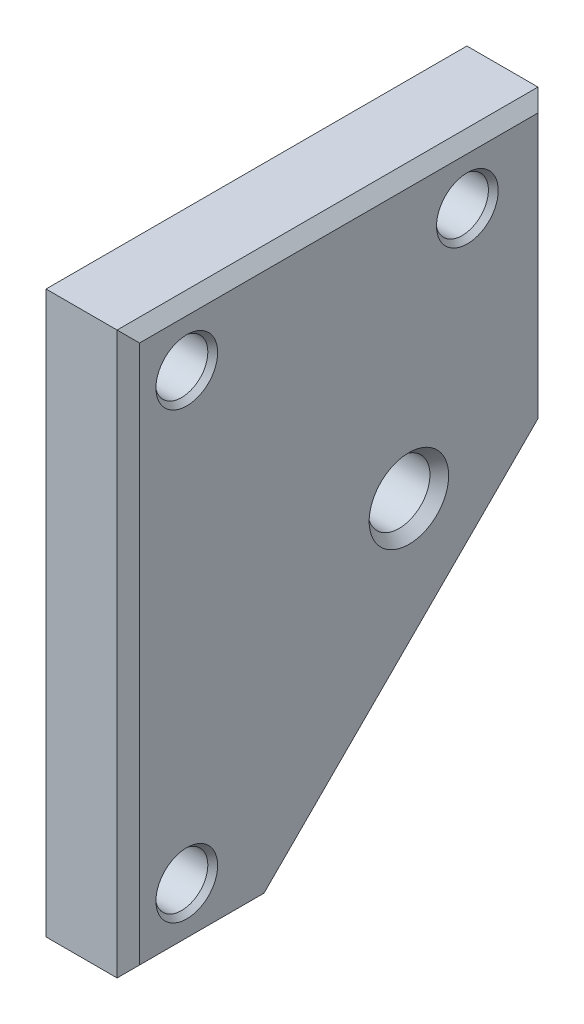
ISO-10303-21;
HEADER;
FILE_DESCRIPTION(('STEP AP214'),'2;1');
FILE_NAME('part.step','',(''),(''),'','','');
FILE_SCHEMA(('AUTOMOTIVE_DESIGN { 1 0 10303 214 1 1 1 1 }'));
ENDSEC;
DATA;
#1=APPLICATION_CONTEXT('core data for automotive mechanical design processes');
#2=APPLICATION_PROTOCOL_DEFINITION('international standard','automotive_design',2000,#1);
#3=PRODUCT_CONTEXT('',#1,'mechanical');
#4=PRODUCT('Part','Part','',(#3));
#5=PRODUCT_RELATED_PRODUCT_CATEGORY('part','',(#4));
#6=PRODUCT_DEFINITION_FORMATION('','',#4);
#7=PRODUCT_DEFINITION_CONTEXT('part definition',#1,'design');
#8=PRODUCT_DEFINITION('design','',#6,#7);
#9=PRODUCT_DEFINITION_SHAPE('','',#8);
#10=(LENGTH_UNIT() NAMED_UNIT(*) SI_UNIT(.MILLI.,.METRE.));
#11=(NAMED_UNIT(*) PLANE_ANGLE_UNIT() SI_UNIT($,.RADIAN.));
#12=(NAMED_UNIT(*) SI_UNIT($,.STERADIAN.) SOLID_ANGLE_UNIT());
#13=UNCERTAINTY_MEASURE_WITH_UNIT(LENGTH_MEASURE(1.E-05),#10,'distance_accuracy_value','');
#14=(GEOMETRIC_REPRESENTATION_CONTEXT(3) GLOBAL_UNCERTAINTY_ASSIGNED_CONTEXT((#13)) GLOBAL_UNIT_ASSIGNED_CONTEXT((#10,
#11,#12)) REPRESENTATION_CONTEXT('',''));
#15=CARTESIAN_POINT('',(0.,0.,0.));
#16=DIRECTION('',(0.,0.,1.));
#17=DIRECTION('',(1.,0.,0.));
#18=AXIS2_PLACEMENT_3D('',#15,#16,#17);
#19=CARTESIAN_POINT('',(12.7,38.1,28.575));
#20=DIRECTION('',(0.,0.,-1.));
#21=DIRECTION('',(-1.,0.,0.));
#22=AXIS2_PLACEMENT_3D('',#19,#20,#21);
#23=PLANE('',#22);
#24=DIRECTION('',(-1.,0.,0.));
#25=VECTOR('',#24,1.);
#26=CARTESIAN_POINT('',(12.7,38.1,28.575));
#27=LINE('',#26,#25);
#28=CARTESIAN_POINT('',(11.176,38.1,28.575));
#29=VERTEX_POINT('',#28);
#30=CARTESIAN_POINT('',(1.52399999999998,38.1,28.575));
#31=VERTEX_POINT('',#30);
#32=EDGE_CURVE('E2512',#29,#31,#27,.T.);
#33=ORIENTED_EDGE('',*,*,#32,.T.);
#34=DIRECTION('',(0.,-1.,0.));
#35=VECTOR('',#34,1.);
#36=CARTESIAN_POINT('',(1.52399999999998,38.1,28.575));
#37=LINE('',#36,#35);
#38=CARTESIAN_POINT('',(1.52399999999998,-38.1,28.575));
#39=VERTEX_POINT('',#38);
#40=EDGE_CURVE('E2452',#31,#39,#37,.T.);
#41=ORIENTED_EDGE('',*,*,#40,.T.);
#42=DIRECTION('',(-1.,0.,0.));
#43=VECTOR('',#42,1.);
#44=CARTESIAN_POINT('',(12.7,-38.1,28.575));
#45=LINE('',#44,#43);
#46=CARTESIAN_POINT('',(11.176,-38.1,28.575));
#47=VERTEX_POINT('',#46);
#48=EDGE_CURVE('E2426',#47,#39,#45,.T.);
#49=ORIENTED_EDGE('',*,*,#48,.F.);
#50=DIRECTION('',(0.,1.,0.));
#51=VECTOR('',#50,1.);
#52=CARTESIAN_POINT('',(11.176,38.1,28.575));
#53=LINE('',#52,#51);
#54=EDGE_CURVE('E2450',#47,#29,#53,.T.);
#55=ORIENTED_EDGE('',*,*,#54,.T.);
#56=EDGE_LOOP('',(#33,#41,#49,#55));
#57=FACE_BOUND('',#56,.T.);
#58=ADVANCED_FACE('F2329',(#57),#23,.F.);
#59=CARTESIAN_POINT('',(12.7,-38.1,28.575));
#60=DIRECTION('',(0.,1.,0.));
#61=DIRECTION('',(0.,0.,1.));
#62=AXIS2_PLACEMENT_3D('',#59,#60,#61);
#63=PLANE('',#62);
#64=ORIENTED_EDGE('',*,*,#48,.T.);
#65=DIRECTION('',(0.,0.,-1.));
#66=VECTOR('',#65,1.);
#67=CARTESIAN_POINT('',(1.52399999999998,-38.1,28.575));
#68=LINE('',#67,#66);
#69=CARTESIAN_POINT('',(1.52399999999998,-38.1,9.525));
#70=VERTEX_POINT('',#69);
#71=EDGE_CURVE('E2456',#39,#70,#68,.T.);
#72=ORIENTED_EDGE('',*,*,#71,.T.);
#73=DIRECTION('',(1.,0.,0.));
#74=VECTOR('',#73,1.);
#75=CARTESIAN_POINT('',(0.,-38.1,9.525));
#76=LINE('',#75,#74);
#77=CARTESIAN_POINT('',(11.176,-38.1,9.525));
#78=VERTEX_POINT('',#77);
#79=EDGE_CURVE('E2536',#70,#78,#76,.T.);
#80=ORIENTED_EDGE('',*,*,#79,.T.);
#81=DIRECTION('',(0.,0.,1.));
#82=VECTOR('',#81,1.);
#83=CARTESIAN_POINT('',(11.176,-38.1,28.575));
#84=LINE('',#83,#82);
#85=EDGE_CURVE('E2454',#78,#47,#84,.T.);
#86=ORIENTED_EDGE('',*,*,#85,.T.);
#87=EDGE_LOOP('',(#64,#72,#80,#86));
#88=FACE_BOUND('',#87,.T.);
#89=ADVANCED_FACE('F2599',(#88),#63,.F.);
#90=CARTESIAN_POINT('',(12.7,38.1,-28.575));
#91=DIRECTION('',(0.,0.,1.));
#92=DIRECTION('',(1.,0.,0.));
#93=AXIS2_PLACEMENT_3D('',#90,#91,#92);
#94=PLANE('',#93);
#95=DIRECTION('',(1.,0.,0.));
#96=VECTOR('',#95,1.);
#97=CARTESIAN_POINT('',(0.,0.,-28.575));
#98=LINE('',#97,#96);
#99=CARTESIAN_POINT('',(1.52399999999998,0.,-28.575));
#100=VERTEX_POINT('',#99);
#101=CARTESIAN_POINT('',(11.176,0.,-28.575));
#102=VERTEX_POINT('',#101);
#103=EDGE_CURVE('E2472',#100,#102,#98,.T.);
#104=ORIENTED_EDGE('',*,*,#103,.F.);
#105=DIRECTION('',(0.,1.,0.));
#106=VECTOR('',#105,1.);
#107=CARTESIAN_POINT('',(1.52399999999998,38.1,-28.575));
#108=LINE('',#107,#106);
#109=CARTESIAN_POINT('',(1.52399999999998,38.1,-28.575));
#110=VERTEX_POINT('',#109);
#111=EDGE_CURVE('E2444',#100,#110,#108,.T.);
#112=ORIENTED_EDGE('',*,*,#111,.T.);
#113=DIRECTION('',(-1.,0.,0.));
#114=VECTOR('',#113,1.);
#115=CARTESIAN_POINT('',(12.7,38.1,-28.575));
#116=LINE('',#115,#114);
#117=CARTESIAN_POINT('',(11.176,38.1,-28.575));
#118=VERTEX_POINT('',#117);
#119=EDGE_CURVE('E2509',#118,#110,#116,.T.);
#120=ORIENTED_EDGE('',*,*,#119,.F.);
#121=DIRECTION('',(0.,-1.,0.));
#122=VECTOR('',#121,1.);
#123=CARTESIAN_POINT('',(11.176,0.,-28.575));
#124=LINE('',#123,#122);
#125=EDGE_CURVE('E2441',#118,#102,#124,.T.);
#126=ORIENTED_EDGE('',*,*,#125,.T.);
#127=EDGE_LOOP('',(#104,#112,#120,#126));
#128=FACE_BOUND('',#127,.T.);
#129=ADVANCED_FACE('F2515',(#128),#94,.F.);
#130=CARTESIAN_POINT('',(12.7,38.1,28.575));
#131=DIRECTION('',(0.,-1.,0.));
#132=DIRECTION('',(0.,0.,-1.));
#133=AXIS2_PLACEMENT_3D('',#130,#131,#132);
#134=PLANE('',#133);
#135=ORIENTED_EDGE('',*,*,#119,.T.);
#136=DIRECTION('',(0.,0.,1.));
#137=VECTOR('',#136,1.);
#138=CARTESIAN_POINT('',(1.52399999999998,38.1,28.575));
#139=LINE('',#138,#137);
#140=EDGE_CURVE('E2448',#110,#31,#139,.T.);
#141=ORIENTED_EDGE('',*,*,#140,.T.);
#142=ORIENTED_EDGE('',*,*,#32,.F.);
#143=DIRECTION('',(0.,0.,-1.));
#144=VECTOR('',#143,1.);
#145=CARTESIAN_POINT('',(11.176,38.1,-28.575));
#146=LINE('',#145,#144);
#147=EDGE_CURVE('E2446',#29,#118,#146,.T.);
#148=ORIENTED_EDGE('',*,*,#147,.T.);
#149=EDGE_LOOP('',(#135,#141,#142,#148));
#150=FACE_BOUND('',#149,.T.);
#151=ADVANCED_FACE('F2508',(#150),#134,.F.);
#152=CARTESIAN_POINT('',(12.7,-38.1,28.575));
#153=DIRECTION('',(1.,0.,0.));
#154=DIRECTION('',(0.,0.,-1.));
#155=AXIS2_PLACEMENT_3D('',#152,#153,#154);
#156=PLANE('',#155);
#157=DIRECTION('',(0.,0.707106781186547,-0.707106781186548));
#158=VECTOR('',#157,1.);
#159=CARTESIAN_POINT('',(12.7,1.07763073452828,-27.4973692654717));
#160=LINE('',#159,#158);
#161=CARTESIAN_POINT('',(12.7,-36.576,10.1562614690566));
#162=VERTEX_POINT('',#161);
#163=CARTESIAN_POINT('',(12.7,0.631261469056575,-27.051));
#164=VERTEX_POINT('',#163);
#165=EDGE_CURVE('E2338',#162,#164,#160,.T.);
#166=ORIENTED_EDGE('',*,*,#165,.T.);
#167=DIRECTION('',(0.,1.,0.));
#168=VECTOR('',#167,1.);
#169=CARTESIAN_POINT('',(12.7,38.1,-27.051));
#170=LINE('',#169,#168);
#171=CARTESIAN_POINT('',(12.7,36.576,-27.051));
#172=VERTEX_POINT('',#171);
#173=EDGE_CURVE('E14',#164,#172,#170,.T.);
#174=ORIENTED_EDGE('',*,*,#173,.T.);
#175=DIRECTION('',(0.,0.,1.));
#176=VECTOR('',#175,1.);
#177=CARTESIAN_POINT('',(12.7,36.576,28.575));
#178=LINE('',#177,#176);
#179=CARTESIAN_POINT('',(12.7,36.576,27.051));
#180=VERTEX_POINT('',#179);
#181=EDGE_CURVE('E2458',#172,#180,#178,.T.);
#182=ORIENTED_EDGE('',*,*,#181,.T.);
#183=DIRECTION('',(0.,-1.,0.));
#184=VECTOR('',#183,1.);
#185=CARTESIAN_POINT('',(12.7,-38.1,27.051));
#186=LINE('',#185,#184);
#187=CARTESIAN_POINT('',(12.7,-36.576,27.051));
#188=VERTEX_POINT('',#187);
#189=EDGE_CURVE('E2460',#180,#188,#186,.T.);
#190=ORIENTED_EDGE('',*,*,#189,.T.);
#191=DIRECTION('',(0.,0.,-1.));
#192=VECTOR('',#191,1.);
#193=CARTESIAN_POINT('',(12.7,-36.576,9.525));
#194=LINE('',#193,#192);
#195=EDGE_CURVE('E2349',#188,#162,#194,.T.);
#196=ORIENTED_EDGE('',*,*,#195,.T.);
#197=EDGE_LOOP('',(#166,#174,#182,#190,#196));
#198=FACE_BOUND('',#197,.T.);
#199=CARTESIAN_POINT('',(12.7,0.,-9.525));
#200=DIRECTION('',(1.,0.,0.));
#201=DIRECTION('',(0.,0.,-1.));
#202=AXIS2_PLACEMENT_3D('',#199,#200,#201);
#203=CIRCLE('',#202,5.3975);
#204=CARTESIAN_POINT('',(12.7,0.,-14.9225));
#205=VERTEX_POINT('',#204);
#206=EDGE_CURVE('E2549',#205,#205,#203,.T.);
#207=ORIENTED_EDGE('',*,*,#206,.F.);
#208=EDGE_LOOP('',(#207));
#209=FACE_BOUND('',#208,.T.);
#210=CARTESIAN_POINT('',(12.7,30.1625,20.6375));
#211=DIRECTION('',(1.,0.,0.));
#212=DIRECTION('',(0.,0.,-1.));
#213=AXIS2_PLACEMENT_3D('',#210,#211,#212);
#214=CIRCLE('',#213,4.191);
#215=CARTESIAN_POINT('',(12.7,30.1625,16.4465));
#216=VERTEX_POINT('',#215);
#217=EDGE_CURVE('E2561',#216,#216,#214,.T.);
#218=ORIENTED_EDGE('',*,*,#217,.F.);
#219=EDGE_LOOP('',(#218));
#220=FACE_BOUND('',#219,.T.);
#221=CARTESIAN_POINT('',(12.7,-30.1625,20.6375));
#222=DIRECTION('',(1.,0.,0.));
#223=DIRECTION('',(0.,0.,-1.));
#224=AXIS2_PLACEMENT_3D('',#221,#222,#223);
#225=CIRCLE('',#224,4.191);
#226=CARTESIAN_POINT('',(12.7,-30.1625,16.4465));
#227=VERTEX_POINT('',#226);
#228=EDGE_CURVE('E2573',#227,#227,#225,.T.);
#229=ORIENTED_EDGE('',*,*,#228,.F.);
#230=EDGE_LOOP('',(#229));
#231=FACE_BOUND('',#230,.T.);
#232=CARTESIAN_POINT('',(12.7,30.1625,-17.4625));
#233=DIRECTION('',(1.,0.,0.));
#234=DIRECTION('',(0.,0.,-1.));
#235=AXIS2_PLACEMENT_3D('',#232,#233,#234);
#236=CIRCLE('',#235,4.191);
#237=CARTESIAN_POINT('',(12.7,30.1625,-21.6535));
#238=VERTEX_POINT('',#237);
#239=EDGE_CURVE('E2521',#238,#238,#236,.T.);
#240=ORIENTED_EDGE('',*,*,#239,.F.);
#241=EDGE_LOOP('',(#240));
#242=FACE_BOUND('',#241,.T.);
#243=ADVANCED_FACE('F2499',(#198,#209,#220,#231,#242),#156,.T.);
#244=CARTESIAN_POINT('',(0.,-38.1,28.575));
#245=DIRECTION('',(1.,0.,0.));
#246=DIRECTION('',(0.,0.,-1.));
#247=AXIS2_PLACEMENT_3D('',#244,#245,#246);
#248=PLANE('',#247);
#249=DIRECTION('',(0.,-1.,0.));
#250=VECTOR('',#249,1.);
#251=CARTESIAN_POINT('',(0.,-38.1,-27.051));
#252=LINE('',#251,#250);
#253=CARTESIAN_POINT('',(0.,36.576,-27.051));
#254=VERTEX_POINT('',#253);
#255=CARTESIAN_POINT('',(0.,0.631261469056589,-27.051));
#256=VERTEX_POINT('',#255);
#257=EDGE_CURVE('E2431',#254,#256,#252,.T.);
#258=ORIENTED_EDGE('',*,*,#257,.T.);
#259=DIRECTION('',(0.,-0.707106781186547,0.707106781186548));
#260=VECTOR('',#259,1.);
#261=CARTESIAN_POINT('',(0.,-46.5473692654717,20.1276307345283));
#262=LINE('',#261,#260);
#263=CARTESIAN_POINT('',(0.,-36.576,10.1562614690566));
#264=VERTEX_POINT('',#263);
#265=EDGE_CURVE('E2411',#256,#264,#262,.T.);
#266=ORIENTED_EDGE('',*,*,#265,.T.);
#267=DIRECTION('',(0.,0.,1.));
#268=VECTOR('',#267,1.);
#269=CARTESIAN_POINT('',(0.,-36.576,28.575));
#270=LINE('',#269,#268);
#271=CARTESIAN_POINT('',(0.,-36.576,27.051));
#272=VERTEX_POINT('',#271);
#273=EDGE_CURVE('E2419',#264,#272,#270,.T.);
#274=ORIENTED_EDGE('',*,*,#273,.T.);
#275=DIRECTION('',(0.,1.,0.));
#276=VECTOR('',#275,1.);
#277=CARTESIAN_POINT('',(0.,-38.1,27.051));
#278=LINE('',#277,#276);
#279=CARTESIAN_POINT('',(0.,36.576,27.051));
#280=VERTEX_POINT('',#279);
#281=EDGE_CURVE('E2425',#272,#280,#278,.T.);
#282=ORIENTED_EDGE('',*,*,#281,.T.);
#283=DIRECTION('',(0.,0.,-1.));
#284=VECTOR('',#283,1.);
#285=CARTESIAN_POINT('',(0.,36.576,28.575));
#286=LINE('',#285,#284);
#287=EDGE_CURVE('E2436',#280,#254,#286,.T.);
#288=ORIENTED_EDGE('',*,*,#287,.T.);
#289=EDGE_LOOP('',(#258,#266,#274,#282,#288));
#290=FACE_BOUND('',#289,.T.);
#291=CARTESIAN_POINT('',(0.,0.,-9.525));
#292=DIRECTION('',(1.,0.,0.));
#293=DIRECTION('',(0.,0.,-1.));
#294=AXIS2_PLACEMENT_3D('',#291,#292,#293);
#295=CIRCLE('',#294,5.3975);
#296=CARTESIAN_POINT('',(0.,0.,-14.9225));
#297=VERTEX_POINT('',#296);
#298=EDGE_CURVE('E2538',#297,#297,#295,.T.);
#299=ORIENTED_EDGE('',*,*,#298,.T.);
#300=EDGE_LOOP('',(#299));
#301=FACE_BOUND('',#300,.T.);
#302=CARTESIAN_POINT('',(0.,30.1625,20.6375));
#303=DIRECTION('',(1.,0.,0.));
#304=DIRECTION('',(0.,0.,-1.));
#305=AXIS2_PLACEMENT_3D('',#302,#303,#304);
#306=CIRCLE('',#305,4.191);
#307=CARTESIAN_POINT('',(0.,30.1625,16.4465));
#308=VERTEX_POINT('',#307);
#309=EDGE_CURVE('E2552',#308,#308,#306,.T.);
#310=ORIENTED_EDGE('',*,*,#309,.T.);
#311=EDGE_LOOP('',(#310));
#312=FACE_BOUND('',#311,.T.);
#313=CARTESIAN_POINT('',(0.,-30.1625,20.6375));
#314=DIRECTION('',(1.,0.,0.));
#315=DIRECTION('',(0.,0.,-1.));
#316=AXIS2_PLACEMENT_3D('',#313,#314,#315);
#317=CIRCLE('',#316,4.191);
#318=CARTESIAN_POINT('',(0.,-30.1625,16.4465));
#319=VERTEX_POINT('',#318);
#320=EDGE_CURVE('E2564',#319,#319,#317,.T.);
#321=ORIENTED_EDGE('',*,*,#320,.T.);
#322=EDGE_LOOP('',(#321));
#323=FACE_BOUND('',#322,.T.);
#324=CARTESIAN_POINT('',(0.,30.1625,-17.4625));
#325=DIRECTION('',(1.,0.,0.));
#326=DIRECTION('',(0.,0.,-1.));
#327=AXIS2_PLACEMENT_3D('',#324,#325,#326);
#328=CIRCLE('',#327,4.191);
#329=CARTESIAN_POINT('',(0.,30.1625,-21.6535));
#330=VERTEX_POINT('',#329);
#331=EDGE_CURVE('E2576',#330,#330,#328,.T.);
#332=ORIENTED_EDGE('',*,*,#331,.T.);
#333=EDGE_LOOP('',(#332));
#334=FACE_BOUND('',#333,.T.);
#335=ADVANCED_FACE('F2428',(#290,#301,#312,#323,#334),#248,.F.);
#336=CARTESIAN_POINT('',(12.7,30.1625,-17.4625));
#337=DIRECTION('',(1.,0.,0.));
#338=DIRECTION('',(0.,0.,-1.));
#339=AXIS2_PLACEMENT_3D('',#336,#337,#338);
#340=CONICAL_SURFACE('',#339,4.191,0.715584993317678);
#341=CARTESIAN_POINT('',(11.9870476759407,30.1625,-17.4625));
#342=DIRECTION('',(1.,0.,0.));
#343=DIRECTION('',(0.,0.,-1.));
#344=AXIS2_PLACEMENT_3D('',#341,#342,#343);
#345=CIRCLE('',#344,3.57124);
#346=CARTESIAN_POINT('',(11.9870476759407,30.1625,-21.03374));
#347=VERTEX_POINT('',#346);
#348=EDGE_CURVE('E2582',#347,#347,#345,.T.);
#349=ORIENTED_EDGE('',*,*,#348,.F.);
#350=EDGE_LOOP('',(#349));
#351=FACE_BOUND('',#350,.T.);
#352=ORIENTED_EDGE('',*,*,#239,.T.);
#353=EDGE_LOOP('',(#352));
#354=FACE_BOUND('',#353,.T.);
#355=ADVANCED_FACE('F2587',(#351,#354),#340,.F.);
#356=CARTESIAN_POINT('',(12.7,30.1625,-17.4625));
#357=DIRECTION('',(1.,0.,0.));
#358=DIRECTION('',(0.,0.,-1.));
#359=AXIS2_PLACEMENT_3D('',#356,#357,#358);
#360=CYLINDRICAL_SURFACE('',#359,3.57124);
#361=CARTESIAN_POINT('',(0.712952324059294,30.1625,-17.4625));
#362=DIRECTION('',(1.,0.,0.));
#363=DIRECTION('',(0.,0.,-1.));
#364=AXIS2_PLACEMENT_3D('',#361,#362,#363);
#365=CIRCLE('',#364,3.57124);
#366=CARTESIAN_POINT('',(0.712952324059294,30.1625,-21.03374));
#367=VERTEX_POINT('',#366);
#368=EDGE_CURVE('E2579',#367,#367,#365,.T.);
#369=ORIENTED_EDGE('',*,*,#368,.F.);
#370=EDGE_LOOP('',(#369));
#371=FACE_BOUND('',#370,.T.);
#372=ORIENTED_EDGE('',*,*,#348,.T.);
#373=EDGE_LOOP('',(#372));
#374=FACE_BOUND('',#373,.T.);
#375=ADVANCED_FACE('F2738',(#371,#374),#360,.F.);
#376=CARTESIAN_POINT('',(0.712952324059294,30.1625,-17.4625));
#377=DIRECTION('',(-1.,0.,0.));
#378=DIRECTION('',(0.,0.,1.));
#379=AXIS2_PLACEMENT_3D('',#376,#377,#378);
#380=CONICAL_SURFACE('',#379,3.57124,0.715584993317677);
#381=ORIENTED_EDGE('',*,*,#331,.F.);
#382=EDGE_LOOP('',(#381));
#383=FACE_BOUND('',#382,.T.);
#384=ORIENTED_EDGE('',*,*,#368,.T.);
#385=EDGE_LOOP('',(#384));
#386=FACE_BOUND('',#385,.T.);
#387=ADVANCED_FACE('F2730',(#383,#386),#380,.F.);
#388=CARTESIAN_POINT('',(12.7,-30.1625,20.6375));
#389=DIRECTION('',(1.,0.,0.));
#390=DIRECTION('',(0.,0.,-1.));
#391=AXIS2_PLACEMENT_3D('',#388,#389,#390);
#392=CONICAL_SURFACE('',#391,4.191,0.715584993317676);
#393=CARTESIAN_POINT('',(11.9870476759407,-30.1625,20.6375));
#394=DIRECTION('',(1.,0.,0.));
#395=DIRECTION('',(0.,0.,-1.));
#396=AXIS2_PLACEMENT_3D('',#393,#394,#395);
#397=CIRCLE('',#396,3.57124);
#398=CARTESIAN_POINT('',(11.9870476759407,-30.1625,17.06626));
#399=VERTEX_POINT('',#398);
#400=EDGE_CURVE('E2570',#399,#399,#397,.T.);
#401=ORIENTED_EDGE('',*,*,#400,.F.);
#402=EDGE_LOOP('',(#401));
#403=FACE_BOUND('',#402,.T.);
#404=ORIENTED_EDGE('',*,*,#228,.T.);
#405=EDGE_LOOP('',(#404));
#406=FACE_BOUND('',#405,.T.);
#407=ADVANCED_FACE('F2722',(#403,#406),#392,.F.);
#408=CARTESIAN_POINT('',(12.7,-30.1625,20.6375));
#409=DIRECTION('',(1.,0.,0.));
#410=DIRECTION('',(0.,0.,-1.));
#411=AXIS2_PLACEMENT_3D('',#408,#409,#410);
#412=CYLINDRICAL_SURFACE('',#411,3.57124);
#413=CARTESIAN_POINT('',(0.712952324059294,-30.1625,20.6375));
#414=DIRECTION('',(1.,0.,0.));
#415=DIRECTION('',(0.,0.,-1.));
#416=AXIS2_PLACEMENT_3D('',#413,#414,#415);
#417=CIRCLE('',#416,3.57124);
#418=CARTESIAN_POINT('',(0.712952324059294,-30.1625,17.06626));
#419=VERTEX_POINT('',#418);
#420=EDGE_CURVE('E2567',#419,#419,#417,.T.);
#421=ORIENTED_EDGE('',*,*,#420,.F.);
#422=EDGE_LOOP('',(#421));
#423=FACE_BOUND('',#422,.T.);
#424=ORIENTED_EDGE('',*,*,#400,.T.);
#425=EDGE_LOOP('',(#424));
#426=FACE_BOUND('',#425,.T.);
#427=ADVANCED_FACE('F2714',(#423,#426),#412,.F.);
#428=CARTESIAN_POINT('',(0.712952324059294,-30.1625,20.6375));
#429=DIRECTION('',(-1.,0.,0.));
#430=DIRECTION('',(0.,0.,1.));
#431=AXIS2_PLACEMENT_3D('',#428,#429,#430);
#432=CONICAL_SURFACE('',#431,3.57124,0.715584993317674);
#433=ORIENTED_EDGE('',*,*,#320,.F.);
#434=EDGE_LOOP('',(#433));
#435=FACE_BOUND('',#434,.T.);
#436=ORIENTED_EDGE('',*,*,#420,.T.);
#437=EDGE_LOOP('',(#436));
#438=FACE_BOUND('',#437,.T.);
#439=ADVANCED_FACE('F2706',(#435,#438),#432,.F.);
#440=CARTESIAN_POINT('',(12.7,30.1625,20.6375));
#441=DIRECTION('',(1.,0.,0.));
#442=DIRECTION('',(0.,0.,-1.));
#443=AXIS2_PLACEMENT_3D('',#440,#441,#442);
#444=CONICAL_SURFACE('',#443,4.191,0.715584993317673);
#445=CARTESIAN_POINT('',(11.9870476759407,30.1625,20.6375));
#446=DIRECTION('',(1.,0.,0.));
#447=DIRECTION('',(0.,0.,-1.));
#448=AXIS2_PLACEMENT_3D('',#445,#446,#447);
#449=CIRCLE('',#448,3.57124);
#450=CARTESIAN_POINT('',(11.9870476759407,30.1625,17.06626));
#451=VERTEX_POINT('',#450);
#452=EDGE_CURVE('E2558',#451,#451,#449,.T.);
#453=ORIENTED_EDGE('',*,*,#452,.F.);
#454=EDGE_LOOP('',(#453));
#455=FACE_BOUND('',#454,.T.);
#456=ORIENTED_EDGE('',*,*,#217,.T.);
#457=EDGE_LOOP('',(#456));
#458=FACE_BOUND('',#457,.T.);
#459=ADVANCED_FACE('F2698',(#455,#458),#444,.F.);
#460=CARTESIAN_POINT('',(12.7,30.1625,20.6375));
#461=DIRECTION('',(1.,0.,0.));
#462=DIRECTION('',(0.,0.,-1.));
#463=AXIS2_PLACEMENT_3D('',#460,#461,#462);
#464=CYLINDRICAL_SURFACE('',#463,3.57124);
#465=CARTESIAN_POINT('',(0.712952324059294,30.1625,20.6375));
#466=DIRECTION('',(1.,0.,0.));
#467=DIRECTION('',(0.,0.,-1.));
#468=AXIS2_PLACEMENT_3D('',#465,#466,#467);
#469=CIRCLE('',#468,3.57124);
#470=CARTESIAN_POINT('',(0.712952324059294,30.1625,17.06626));
#471=VERTEX_POINT('',#470);
#472=EDGE_CURVE('E2555',#471,#471,#469,.T.);
#473=ORIENTED_EDGE('',*,*,#472,.F.);
#474=EDGE_LOOP('',(#473));
#475=FACE_BOUND('',#474,.T.);
#476=ORIENTED_EDGE('',*,*,#452,.T.);
#477=EDGE_LOOP('',(#476));
#478=FACE_BOUND('',#477,.T.);
#479=ADVANCED_FACE('F2690',(#475,#478),#464,.F.);
#480=CARTESIAN_POINT('',(0.712952324059294,30.1625,20.6375));
#481=DIRECTION('',(-1.,0.,0.));
#482=DIRECTION('',(0.,0.,1.));
#483=AXIS2_PLACEMENT_3D('',#480,#481,#482);
#484=CONICAL_SURFACE('',#483,3.57124,0.715584993317672);
#485=ORIENTED_EDGE('',*,*,#309,.F.);
#486=EDGE_LOOP('',(#485));
#487=FACE_BOUND('',#486,.T.);
#488=ORIENTED_EDGE('',*,*,#472,.T.);
#489=EDGE_LOOP('',(#488));
#490=FACE_BOUND('',#489,.T.);
#491=ADVANCED_FACE('F2682',(#487,#490),#484,.F.);
#492=CARTESIAN_POINT('',(12.7,0.,-9.525));
#493=DIRECTION('',(1.,0.,0.));
#494=DIRECTION('',(0.,0.,-1.));
#495=AXIS2_PLACEMENT_3D('',#492,#493,#494);
#496=CONICAL_SURFACE('',#495,5.3975,0.715584993317675);
#497=CARTESIAN_POINT('',(11.3412998742313,0.,-9.525));
#498=DIRECTION('',(1.,0.,0.));
#499=DIRECTION('',(0.,0.,-1.));
#500=AXIS2_PLACEMENT_3D('',#497,#498,#499);
#501=CIRCLE('',#500,4.2164);
#502=CARTESIAN_POINT('',(11.3412998742313,0.,-13.7414));
#503=VERTEX_POINT('',#502);
#504=EDGE_CURVE('E2546',#503,#503,#501,.T.);
#505=ORIENTED_EDGE('',*,*,#504,.F.);
#506=EDGE_LOOP('',(#505));
#507=FACE_BOUND('',#506,.T.);
#508=ORIENTED_EDGE('',*,*,#206,.T.);
#509=EDGE_LOOP('',(#508));
#510=FACE_BOUND('',#509,.T.);
#511=ADVANCED_FACE('F2674',(#507,#510),#496,.F.);
#512=CARTESIAN_POINT('',(12.7,0.,-9.525));
#513=DIRECTION('',(1.,0.,0.));
#514=DIRECTION('',(0.,0.,-1.));
#515=AXIS2_PLACEMENT_3D('',#512,#513,#514);
#516=CYLINDRICAL_SURFACE('',#515,4.2164);
#517=CARTESIAN_POINT('',(1.35870012576873,0.,-9.525));
#518=DIRECTION('',(1.,0.,0.));
#519=DIRECTION('',(0.,0.,-1.));
#520=AXIS2_PLACEMENT_3D('',#517,#518,#519);
#521=CIRCLE('',#520,4.2164);
#522=CARTESIAN_POINT('',(1.35870012576873,0.,-13.7414));
#523=VERTEX_POINT('',#522);
#524=EDGE_CURVE('E2543',#523,#523,#521,.T.);
#525=ORIENTED_EDGE('',*,*,#524,.F.);
#526=EDGE_LOOP('',(#525));
#527=FACE_BOUND('',#526,.T.);
#528=ORIENTED_EDGE('',*,*,#504,.T.);
#529=EDGE_LOOP('',(#528));
#530=FACE_BOUND('',#529,.T.);
#531=ADVANCED_FACE('F2666',(#527,#530),#516,.F.);
#532=CARTESIAN_POINT('',(1.35870012576873,0.,-9.525));
#533=DIRECTION('',(-1.,0.,0.));
#534=DIRECTION('',(0.,0.,1.));
#535=AXIS2_PLACEMENT_3D('',#532,#533,#534);
#536=CONICAL_SURFACE('',#535,4.2164,0.715584993317677);
#537=ORIENTED_EDGE('',*,*,#298,.F.);
#538=EDGE_LOOP('',(#537));
#539=FACE_BOUND('',#538,.T.);
#540=ORIENTED_EDGE('',*,*,#524,.T.);
#541=EDGE_LOOP('',(#540));
#542=FACE_BOUND('',#541,.T.);
#543=ADVANCED_FACE('F2658',(#539,#542),#536,.F.);
#544=CARTESIAN_POINT('',(0.,-38.1,9.525));
#545=DIRECTION('',(0.,0.707106781186548,0.707106781186548));
#546=DIRECTION('',(0.,-0.707106781186547,0.707106781186548));
#547=AXIS2_PLACEMENT_3D('',#544,#545,#546);
#548=PLANE('',#547);
#549=ORIENTED_EDGE('',*,*,#79,.F.);
#550=DIRECTION('',(0.,0.707106781186547,-0.707106781186548));
#551=VECTOR('',#550,1.);
#552=CARTESIAN_POINT('',(1.52399999999998,-38.1,9.525));
#553=LINE('',#552,#551);
#554=EDGE_CURVE('E2413',#70,#100,#553,.T.);
#555=ORIENTED_EDGE('',*,*,#554,.T.);
#556=ORIENTED_EDGE('',*,*,#103,.T.);
#557=DIRECTION('',(0.,-0.707106781186547,0.707106781186548));
#558=VECTOR('',#557,1.);
#559=CARTESIAN_POINT('',(11.176,-38.1,9.525));
#560=LINE('',#559,#558);
#561=EDGE_CURVE('E2433',#102,#78,#560,.T.);
#562=ORIENTED_EDGE('',*,*,#561,.T.);
#563=EDGE_LOOP('',(#549,#555,#556,#562));
#564=FACE_BOUND('',#563,.T.);
#565=ADVANCED_FACE('F2534',(#564),#548,.F.);
#566=CARTESIAN_POINT('',(1.52399999999998,38.1,28.575));
#567=DIRECTION('',(0.707106781186551,-0.707106781186544,0.));
#568=DIRECTION('',(0.707106781186544,0.707106781186551,0.));
#569=AXIS2_PLACEMENT_3D('',#566,#567,#568);
#570=PLANE('',#569);
#571=DIRECTION('',(-0.577350269189622,-0.577350269189628,0.577350269189628));
#572=VECTOR('',#571,1.);
#573=CARTESIAN_POINT('',(-17.526,19.0499999999999,-9.52499999999988));
#574=LINE('',#573,#572);
#575=EDGE_CURVE('E2466',#254,#110,#574,.F.);
#576=ORIENTED_EDGE('',*,*,#575,.F.);
#577=ORIENTED_EDGE('',*,*,#287,.F.);
#578=DIRECTION('',(-0.577350269189622,-0.577350269189628,-0.577350269189628));
#579=VECTOR('',#578,1.);
#580=CARTESIAN_POINT('',(1.52399999999998,38.1,28.575));
#581=LINE('',#580,#579);
#582=EDGE_CURVE('E2469',#31,#280,#581,.T.);
#583=ORIENTED_EDGE('',*,*,#582,.F.);
#584=ORIENTED_EDGE('',*,*,#140,.F.);
#585=EDGE_LOOP('',(#576,#577,#583,#584));
#586=FACE_BOUND('',#585,.T.);
#587=ADVANCED_FACE('F2529',(#586),#570,.F.);
#588=CARTESIAN_POINT('',(1.52399999999998,38.1,28.575));
#589=DIRECTION('',(0.707106781186551,0.,-0.707106781186544));
#590=DIRECTION('',(-0.707106781186544,0.,-0.707106781186551));
#591=AXIS2_PLACEMENT_3D('',#588,#589,#590);
#592=PLANE('',#591);
#593=ORIENTED_EDGE('',*,*,#582,.T.);
#594=ORIENTED_EDGE('',*,*,#281,.F.);
#595=DIRECTION('',(-0.577350269189622,0.577350269189628,-0.577350269189628));
#596=VECTOR('',#595,1.);
#597=CARTESIAN_POINT('',(1.52399999999998,-38.1,28.575));
#598=LINE('',#597,#596);
#599=EDGE_CURVE('E2422',#39,#272,#598,.T.);
#600=ORIENTED_EDGE('',*,*,#599,.F.);
#601=ORIENTED_EDGE('',*,*,#40,.F.);
#602=EDGE_LOOP('',(#593,#594,#600,#601));
#603=FACE_BOUND('',#602,.T.);
#604=ADVANCED_FACE('F2615',(#603),#592,.F.);
#605=CARTESIAN_POINT('',(1.52399999999998,38.1,-28.575));
#606=DIRECTION('',(0.707106781186551,0.,0.707106781186544));
#607=DIRECTION('',(0.707106781186544,0.,-0.707106781186551));
#608=AXIS2_PLACEMENT_3D('',#605,#606,#607);
#609=PLANE('',#608);
#610=ORIENTED_EDGE('',*,*,#575,.T.);
#611=ORIENTED_EDGE('',*,*,#111,.F.);
#612=DIRECTION('',(-0.678598344545844,0.281084637714822,0.67859834454585));
#613=VECTOR('',#612,1.);
#614=CARTESIAN_POINT('',(-5.74333001054383,3.01022665260827,-21.3076699894561));
#615=LINE('',#614,#613);
#616=EDGE_CURVE('E2416',#256,#100,#615,.F.);
#617=ORIENTED_EDGE('',*,*,#616,.F.);
#618=ORIENTED_EDGE('',*,*,#257,.F.);
#619=EDGE_LOOP('',(#610,#611,#617,#618));
#620=FACE_BOUND('',#619,.T.);
#621=ADVANCED_FACE('F2531',(#620),#609,.F.);
#622=CARTESIAN_POINT('',(1.52399999999998,-38.1,28.575));
#623=DIRECTION('',(0.707106781186551,0.707106781186544,0.));
#624=DIRECTION('',(-0.707106781186544,0.707106781186551,0.));
#625=AXIS2_PLACEMENT_3D('',#622,#623,#624);
#626=PLANE('',#625);
#627=ORIENTED_EDGE('',*,*,#599,.T.);
#628=ORIENTED_EDGE('',*,*,#273,.F.);
#629=DIRECTION('',(0.678598344545844,-0.67859834454585,-0.281084637714822));
#630=VECTOR('',#629,1.);
#631=CARTESIAN_POINT('',(-2.10966500527192,-34.4663349947281,11.0301133263041));
#632=LINE('',#631,#630);
#633=EDGE_CURVE('E2407',#70,#264,#632,.F.);
#634=ORIENTED_EDGE('',*,*,#633,.F.);
#635=ORIENTED_EDGE('',*,*,#71,.F.);
#636=EDGE_LOOP('',(#627,#628,#634,#635));
#637=FACE_BOUND('',#636,.T.);
#638=ADVANCED_FACE('F2420',(#637),#626,.F.);
#639=CARTESIAN_POINT('',(0.,-46.5473692654717,20.1276307345283));
#640=DIRECTION('',(0.707106781186551,0.499999999999998,0.499999999999998));
#641=DIRECTION('',(-0.577350269189622,0.816496580927728,0.));
#642=AXIS2_PLACEMENT_3D('',#639,#640,#641);
#643=PLANE('',#642);
#644=ORIENTED_EDGE('',*,*,#616,.T.);
#645=ORIENTED_EDGE('',*,*,#554,.F.);
#646=ORIENTED_EDGE('',*,*,#633,.T.);
#647=ORIENTED_EDGE('',*,*,#265,.F.);
#648=EDGE_LOOP('',(#644,#645,#646,#647));
#649=FACE_BOUND('',#648,.T.);
#650=ADVANCED_FACE('F2409',(#649),#643,.F.);
#651=CARTESIAN_POINT('',(12.7,-36.576,28.575));
#652=DIRECTION('',(0.707106781186544,-0.707106781186551,0.));
#653=DIRECTION('',(0.707106781186551,0.707106781186544,0.));
#654=AXIS2_PLACEMENT_3D('',#651,#652,#653);
#655=PLANE('',#654);
#656=DIRECTION('',(0.678598344545851,0.678598344545845,0.281084637714817));
#657=VECTOR('',#656,1.);
#658=CARTESIAN_POINT('',(16.2132559391676,-33.0627440608325,11.6114997271476));
#659=LINE('',#658,#657);
#660=EDGE_CURVE('E2479',#162,#78,#659,.F.);
#661=ORIENTED_EDGE('',*,*,#660,.F.);
#662=ORIENTED_EDGE('',*,*,#195,.F.);
#663=DIRECTION('',(0.577350269189629,0.577350269189624,-0.577350269189624));
#664=VECTOR('',#663,1.);
#665=CARTESIAN_POINT('',(12.192,-37.084,27.559));
#666=LINE('',#665,#664);
#667=EDGE_CURVE('E2333',#47,#188,#666,.T.);
#668=ORIENTED_EDGE('',*,*,#667,.F.);
#669=ORIENTED_EDGE('',*,*,#85,.F.);
#670=EDGE_LOOP('',(#661,#662,#668,#669));
#671=FACE_BOUND('',#670,.T.);
#672=ADVANCED_FACE('F2331',(#671),#655,.T.);
#673=CARTESIAN_POINT('',(12.7,-38.1,27.051));
#674=DIRECTION('',(0.707106781186544,0.,0.707106781186551));
#675=DIRECTION('',(0.707106781186551,0.,-0.707106781186544));
#676=AXIS2_PLACEMENT_3D('',#673,#674,#675);
#677=PLANE('',#676);
#678=ORIENTED_EDGE('',*,*,#667,.T.);
#679=ORIENTED_EDGE('',*,*,#189,.F.);
#680=DIRECTION('',(0.577350269189629,-0.577350269189624,-0.577350269189624));
#681=VECTOR('',#680,1.);
#682=CARTESIAN_POINT('',(12.192,37.084,27.559));
#683=LINE('',#682,#681);
#684=EDGE_CURVE('E2477',#29,#180,#683,.T.);
#685=ORIENTED_EDGE('',*,*,#684,.F.);
#686=ORIENTED_EDGE('',*,*,#54,.F.);
#687=EDGE_LOOP('',(#678,#679,#685,#686));
#688=FACE_BOUND('',#687,.T.);
#689=ADVANCED_FACE('F2488',(#688),#677,.T.);
#690=CARTESIAN_POINT('',(11.176,-38.1,9.525));
#691=DIRECTION('',(0.707106781186543,-0.500000000000003,-0.500000000000003));
#692=DIRECTION('',(-0.57735026918963,0.,-0.816496580927723));
#693=AXIS2_PLACEMENT_3D('',#690,#691,#692);
#694=PLANE('',#693);
#695=ORIENTED_EDGE('',*,*,#660,.T.);
#696=ORIENTED_EDGE('',*,*,#561,.F.);
#697=DIRECTION('',(0.678598344545851,0.281084637714817,0.678598344545845));
#698=VECTOR('',#697,1.);
#699=CARTESIAN_POINT('',(21.4535566631522,4.25710335793552,-18.2974433368479));
#700=LINE('',#699,#698);
#701=EDGE_CURVE('E2475',#164,#102,#700,.F.);
#702=ORIENTED_EDGE('',*,*,#701,.F.);
#703=ORIENTED_EDGE('',*,*,#165,.F.);
#704=EDGE_LOOP('',(#695,#696,#702,#703));
#705=FACE_BOUND('',#704,.T.);
#706=ADVANCED_FACE('F2492',(#705),#694,.T.);
#707=CARTESIAN_POINT('',(12.7,36.576,28.575));
#708=DIRECTION('',(0.707106781186544,0.707106781186551,0.));
#709=DIRECTION('',(-0.707106781186551,0.707106781186544,0.));
#710=AXIS2_PLACEMENT_3D('',#707,#708,#709);
#711=PLANE('',#710);
#712=ORIENTED_EDGE('',*,*,#684,.T.);
#713=ORIENTED_EDGE('',*,*,#181,.F.);
#714=DIRECTION('',(-0.577350269189629,0.577350269189624,-0.577350269189624));
#715=VECTOR('',#714,1.);
#716=CARTESIAN_POINT('',(31.2420000000001,18.0340000000001,-8.50900000000012));
#717=LINE('',#716,#715);
#718=EDGE_CURVE('E2473',#118,#172,#717,.F.);
#719=ORIENTED_EDGE('',*,*,#718,.F.);
#720=ORIENTED_EDGE('',*,*,#147,.F.);
#721=EDGE_LOOP('',(#712,#713,#719,#720));
#722=FACE_BOUND('',#721,.T.);
#723=ADVANCED_FACE('F2502',(#722),#711,.T.);
#724=CARTESIAN_POINT('',(12.7,-38.1,-27.051));
#725=DIRECTION('',(0.707106781186544,0.,-0.707106781186551));
#726=DIRECTION('',(-0.707106781186551,0.,-0.707106781186544));
#727=AXIS2_PLACEMENT_3D('',#724,#725,#726);
#728=PLANE('',#727);
#729=ORIENTED_EDGE('',*,*,#701,.T.);
#730=ORIENTED_EDGE('',*,*,#125,.F.);
#731=ORIENTED_EDGE('',*,*,#718,.T.);
#732=ORIENTED_EDGE('',*,*,#173,.F.);
#733=EDGE_LOOP('',(#729,#730,#731,#732));
#734=FACE_BOUND('',#733,.T.);
#735=ADVANCED_FACE('F2496',(#734),#728,.T.);
#736=CLOSED_SHELL('',(#58,#89,#129,#151,#243,#335,#355,#375,#387,#407,#427,#439,#459,#479,#491,
#511,#531,#543,#565,#587,#604,#621,#638,#650,#672,#689,#706,#723,#735));
#737=MANIFOLD_SOLID_BREP('B2',#736);
#738=ADVANCED_BREP_SHAPE_REPRESENTATION('',(#18,#737),#14);
#739=SHAPE_DEFINITION_REPRESENTATION(#9,#738);
ENDSEC;
END-ISO-10303-21;
